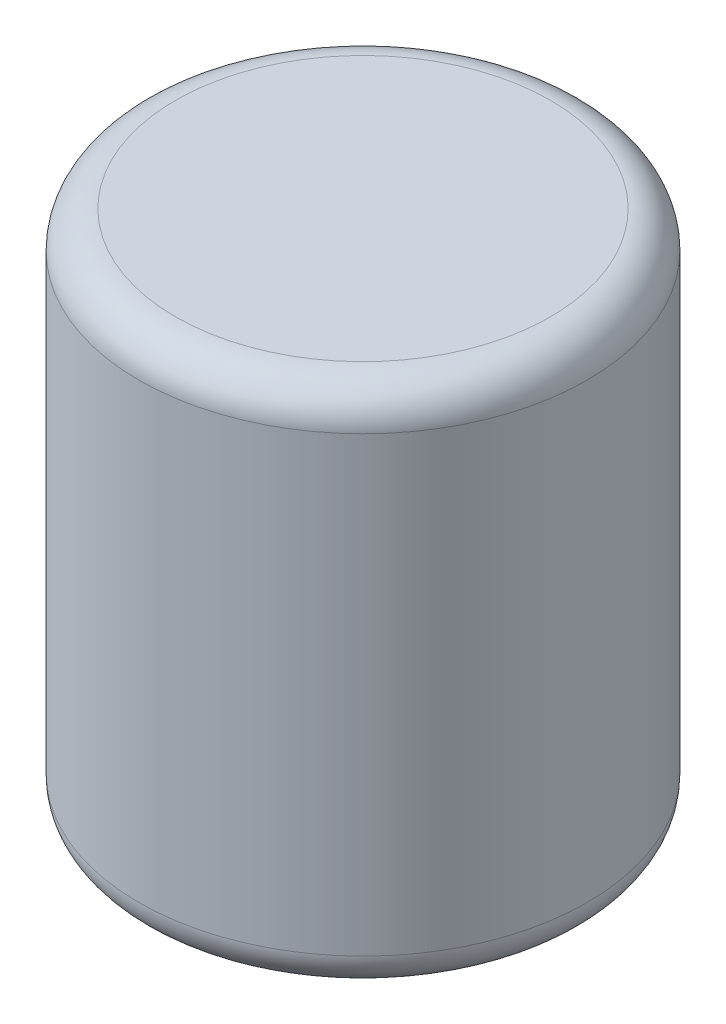
ISO-10303-21;
HEADER;
FILE_DESCRIPTION(('STEP AP214'),'2;1');
FILE_NAME('part.step','',(''),(''),'','','');
FILE_SCHEMA(('AUTOMOTIVE_DESIGN { 1 0 10303 214 1 1 1 1 }'));
ENDSEC;
DATA;
#1=APPLICATION_CONTEXT('core data for automotive mechanical design processes');
#2=APPLICATION_PROTOCOL_DEFINITION('international standard','automotive_design',2000,#1);
#3=PRODUCT_CONTEXT('',#1,'mechanical');
#4=PRODUCT('Part','Part','',(#3));
#5=PRODUCT_RELATED_PRODUCT_CATEGORY('part','',(#4));
#6=PRODUCT_DEFINITION_FORMATION('','',#4);
#7=PRODUCT_DEFINITION_CONTEXT('part definition',#1,'design');
#8=PRODUCT_DEFINITION('design','',#6,#7);
#9=PRODUCT_DEFINITION_SHAPE('','',#8);
#10=(LENGTH_UNIT() NAMED_UNIT(*) SI_UNIT(.MILLI.,.METRE.));
#11=(NAMED_UNIT(*) PLANE_ANGLE_UNIT() SI_UNIT($,.RADIAN.));
#12=(NAMED_UNIT(*) SI_UNIT($,.STERADIAN.) SOLID_ANGLE_UNIT());
#13=UNCERTAINTY_MEASURE_WITH_UNIT(LENGTH_MEASURE(1.E-05),#10,'distance_accuracy_value','');
#14=(GEOMETRIC_REPRESENTATION_CONTEXT(3) GLOBAL_UNCERTAINTY_ASSIGNED_CONTEXT((#13)) GLOBAL_UNIT_ASSIGNED_CONTEXT((#10,
#11,#12)) REPRESENTATION_CONTEXT('',''));
#15=CARTESIAN_POINT('',(0.,0.,0.));
#16=DIRECTION('',(0.,0.,1.));
#17=DIRECTION('',(1.,0.,0.));
#18=AXIS2_PLACEMENT_3D('',#15,#16,#17);
#19=CARTESIAN_POINT('',(0.,72.9742,0.));
#20=DIRECTION('',(0.,-1.,0.));
#21=DIRECTION('',(0.,0.,-1.));
#22=AXIS2_PLACEMENT_3D('',#19,#20,#21);
#23=CYLINDRICAL_SURFACE('',#22,31.115);
#24=CARTESIAN_POINT('',(0.,5.08,0.));
#25=DIRECTION('',(0.,1.,0.));
#26=DIRECTION('',(0.,0.,1.));
#27=AXIS2_PLACEMENT_3D('',#24,#25,#26);
#28=CIRCLE('',#27,31.115);
#29=CARTESIAN_POINT('',(0.,5.08,31.115));
#30=VERTEX_POINT('',#29);
#31=EDGE_CURVE('E41',#30,#30,#28,.T.);
#32=ORIENTED_EDGE('',*,*,#31,.T.);
#33=EDGE_LOOP('',(#32));
#34=FACE_BOUND('',#33,.T.);
#35=CARTESIAN_POINT('',(0.,67.8942,0.));
#36=DIRECTION('',(0.,1.,0.));
#37=DIRECTION('',(0.,0.,1.));
#38=AXIS2_PLACEMENT_3D('',#35,#36,#37);
#39=CIRCLE('',#38,31.115);
#40=CARTESIAN_POINT('',(0.,67.8942,31.115));
#41=VERTEX_POINT('',#40);
#42=EDGE_CURVE('E45',#41,#41,#39,.F.);
#43=ORIENTED_EDGE('',*,*,#42,.T.);
#44=EDGE_LOOP('',(#43));
#45=FACE_BOUND('',#44,.T.);
#46=ADVANCED_FACE('F30',(#34,#45),#23,.T.);
#47=CARTESIAN_POINT('',(0.,72.9742,0.));
#48=DIRECTION('',(0.,1.,0.));
#49=DIRECTION('',(0.,0.,1.));
#50=AXIS2_PLACEMENT_3D('',#47,#48,#49);
#51=PLANE('',#50);
#52=CARTESIAN_POINT('',(0.,72.9742,0.));
#53=DIRECTION('',(0.,1.,0.));
#54=DIRECTION('',(0.,0.,1.));
#55=AXIS2_PLACEMENT_3D('',#52,#53,#54);
#56=CIRCLE('',#55,26.035);
#57=CARTESIAN_POINT('',(0.,72.9742,26.035));
#58=VERTEX_POINT('',#57);
#59=EDGE_CURVE('E10',#58,#58,#56,.T.);
#60=ORIENTED_EDGE('',*,*,#59,.T.);
#61=EDGE_LOOP('',(#60));
#62=FACE_BOUND('',#61,.T.);
#63=ADVANCED_FACE('F61',(#62),#51,.T.);
#64=CARTESIAN_POINT('',(0.,0.,0.));
#65=DIRECTION('',(0.,1.,0.));
#66=DIRECTION('',(0.,0.,1.));
#67=AXIS2_PLACEMENT_3D('',#64,#65,#66);
#68=PLANE('',#67);
#69=CARTESIAN_POINT('',(0.,0.,0.));
#70=DIRECTION('',(0.,1.,0.));
#71=DIRECTION('',(0.,0.,1.));
#72=AXIS2_PLACEMENT_3D('',#69,#70,#71);
#73=CIRCLE('',#72,26.035);
#74=CARTESIAN_POINT('',(0.,0.,26.035));
#75=VERTEX_POINT('',#74);
#76=EDGE_CURVE('E37',#75,#75,#73,.F.);
#77=ORIENTED_EDGE('',*,*,#76,.T.);
#78=EDGE_LOOP('',(#77));
#79=FACE_BOUND('',#78,.T.);
#80=ADVANCED_FACE('F58',(#79),#68,.F.);
#81=CARTESIAN_POINT('',(0.,5.08,0.));
#82=DIRECTION('',(0.,1.,0.));
#83=DIRECTION('',(0.,0.,1.));
#84=AXIS2_PLACEMENT_3D('',#81,#82,#83);
#85=TOROIDAL_SURFACE('',#84,26.035,5.08);
#86=ORIENTED_EDGE('',*,*,#76,.F.);
#87=EDGE_LOOP('',(#86));
#88=FACE_BOUND('',#87,.T.);
#89=ORIENTED_EDGE('',*,*,#31,.F.);
#90=EDGE_LOOP('',(#89));
#91=FACE_BOUND('',#90,.T.);
#92=ADVANCED_FACE('F54',(#88,#91),#85,.T.);
#93=CARTESIAN_POINT('',(0.,67.8942,0.));
#94=DIRECTION('',(0.,1.,0.));
#95=DIRECTION('',(0.,0.,1.));
#96=AXIS2_PLACEMENT_3D('',#93,#94,#95);
#97=TOROIDAL_SURFACE('',#96,26.035,5.08);
#98=ORIENTED_EDGE('',*,*,#42,.F.);
#99=EDGE_LOOP('',(#98));
#100=FACE_BOUND('',#99,.T.);
#101=ORIENTED_EDGE('',*,*,#59,.F.);
#102=EDGE_LOOP('',(#101));
#103=FACE_BOUND('',#102,.T.);
#104=ADVANCED_FACE('F32',(#100,#103),#97,.T.);
#105=CLOSED_SHELL('',(#46,#63,#80,#92,#104));
#106=MANIFOLD_SOLID_BREP('B2',#105);
#107=ADVANCED_BREP_SHAPE_REPRESENTATION('',(#18,#106),#14);
#108=SHAPE_DEFINITION_REPRESENTATION(#9,#107);
ENDSEC;
END-ISO-10303-21;
